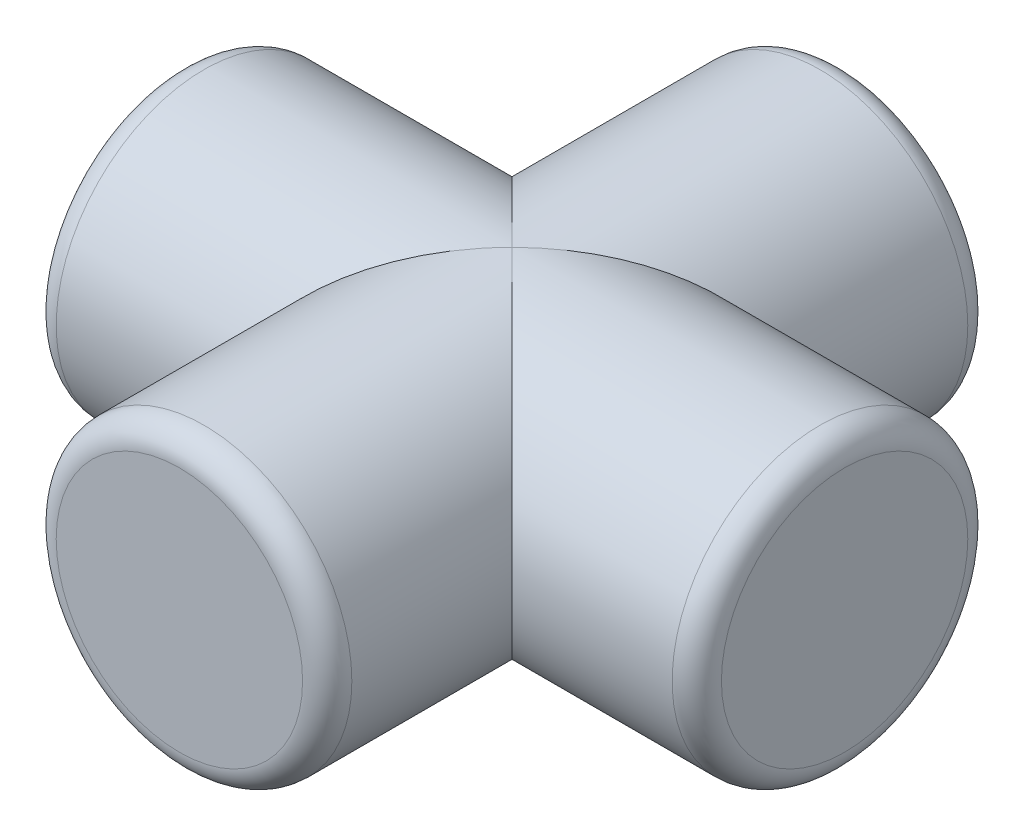
ISO-10303-21;
HEADER;
FILE_DESCRIPTION(('STEP AP214'),'2;1');
FILE_NAME('part.step','',(''),(''),'','','');
FILE_SCHEMA(('AUTOMOTIVE_DESIGN { 1 0 10303 214 1 1 1 1 }'));
ENDSEC;
DATA;
#1=APPLICATION_CONTEXT('core data for automotive mechanical design processes');
#2=APPLICATION_PROTOCOL_DEFINITION('international standard','automotive_design',2000,#1);
#3=PRODUCT_CONTEXT('',#1,'mechanical');
#4=PRODUCT('Part','Part','',(#3));
#5=PRODUCT_RELATED_PRODUCT_CATEGORY('part','',(#4));
#6=PRODUCT_DEFINITION_FORMATION('','',#4);
#7=PRODUCT_DEFINITION_CONTEXT('part definition',#1,'design');
#8=PRODUCT_DEFINITION('design','',#6,#7);
#9=PRODUCT_DEFINITION_SHAPE('','',#8);
#10=(LENGTH_UNIT() NAMED_UNIT(*) SI_UNIT(.MILLI.,.METRE.));
#11=(NAMED_UNIT(*) PLANE_ANGLE_UNIT() SI_UNIT($,.RADIAN.));
#12=(NAMED_UNIT(*) SI_UNIT($,.STERADIAN.) SOLID_ANGLE_UNIT());
#13=UNCERTAINTY_MEASURE_WITH_UNIT(LENGTH_MEASURE(1.E-05),#10,'distance_accuracy_value','');
#14=(GEOMETRIC_REPRESENTATION_CONTEXT(3) GLOBAL_UNCERTAINTY_ASSIGNED_CONTEXT((#13)) GLOBAL_UNIT_ASSIGNED_CONTEXT((#10,
#11,#12)) REPRESENTATION_CONTEXT('',''));
#15=CARTESIAN_POINT('',(0.,0.,0.));
#16=DIRECTION('',(0.,0.,1.));
#17=DIRECTION('',(1.,0.,0.));
#18=AXIS2_PLACEMENT_3D('',#15,#16,#17);
#19=CARTESIAN_POINT('',(-7.59548655631929E-06,0.,51.4350075954866));
#20=DIRECTION('',(0.,0.,-1.));
#21=DIRECTION('',(-1.,0.,0.));
#22=AXIS2_PLACEMENT_3D('',#19,#20,#21);
#23=CYLINDRICAL_SURFACE('',#22,15.24);
#24=CARTESIAN_POINT('',(-7.59548655631929E-06,0.,-14.6049924045134));
#25=DIRECTION('',(0.,0.,1.));
#26=DIRECTION('',(1.,0.,0.));
#27=AXIS2_PLACEMENT_3D('',#24,#25,#26);
#28=CIRCLE('',#27,15.24);
#29=CARTESIAN_POINT('',(15.2399924045134,0.,-14.6049924045134));
#30=VERTEX_POINT('',#29);
#31=EDGE_CURVE('E47',#30,#30,#28,.T.);
#32=ORIENTED_EDGE('',*,*,#31,.T.);
#33=EDGE_LOOP('',(#32));
#34=FACE_BOUND('',#33,.T.);
#35=CARTESIAN_POINT('',(-7.59548655631929E-06,0.,17.1450075954866));
#36=DIRECTION('',(-0.707106781186547,0.,-0.707106781186547));
#37=DIRECTION('',(0.707106781186547,0.,-0.707106781186547));
#38=AXIS2_PLACEMENT_3D('',#35,#36,#37);
#39=ELLIPSE('',#38,21.552614690566,15.24);
#40=CARTESIAN_POINT('',(-7.59548655631929E-06,15.24,17.1450075954866));
#41=VERTEX_POINT('',#40);
#42=CARTESIAN_POINT('',(-7.59548655631929E-06,-15.24,17.1450075954866));
#43=VERTEX_POINT('',#42);
#44=EDGE_CURVE('E59',#41,#43,#39,.T.);
#45=ORIENTED_EDGE('',*,*,#44,.T.);
#46=CARTESIAN_POINT('',(-7.59548655631929E-06,0.,17.1450075954866));
#47=DIRECTION('',(0.707106781186547,0.,-0.707106781186547));
#48=DIRECTION('',(-0.707106781186547,0.,-0.707106781186547));
#49=AXIS2_PLACEMENT_3D('',#46,#47,#48);
#50=ELLIPSE('',#49,21.552614690566,15.24);
#51=EDGE_CURVE('E65',#43,#41,#50,.T.);
#52=ORIENTED_EDGE('',*,*,#51,.T.);
#53=EDGE_LOOP('',(#45,#52));
#54=FACE_BOUND('',#53,.T.);
#55=ADVANCED_FACE('F38',(#34,#54),#23,.T.);
#56=CARTESIAN_POINT('',(-7.59548655631929E-06,0.,-17.1449924045134));
#57=DIRECTION('',(0.,0.,1.));
#58=DIRECTION('',(1.,0.,0.));
#59=AXIS2_PLACEMENT_3D('',#56,#57,#58);
#60=PLANE('',#59);
#61=CARTESIAN_POINT('',(-7.59548655631929E-06,0.,-17.1449924045134));
#62=DIRECTION('',(0.,0.,1.));
#63=DIRECTION('',(1.,0.,0.));
#64=AXIS2_PLACEMENT_3D('',#61,#62,#63);
#65=CIRCLE('',#64,12.7);
#66=CARTESIAN_POINT('',(12.6999924045134,0.,-17.1449924045134));
#67=VERTEX_POINT('',#66);
#68=EDGE_CURVE('E11',#67,#67,#65,.F.);
#69=ORIENTED_EDGE('',*,*,#68,.T.);
#70=EDGE_LOOP('',(#69));
#71=FACE_BOUND('',#70,.T.);
#72=ADVANCED_FACE('F115',(#71),#60,.F.);
#73=CARTESIAN_POINT('',(-34.2900075954866,0.,17.1450075954866));
#74=DIRECTION('',(1.,0.,0.));
#75=DIRECTION('',(0.,0.,-1.));
#76=AXIS2_PLACEMENT_3D('',#73,#74,#75);
#77=PLANE('',#76);
#78=CARTESIAN_POINT('',(-34.2900075954866,0.,17.1450075954866));
#79=DIRECTION('',(1.,0.,0.));
#80=DIRECTION('',(0.,0.,-1.));
#81=AXIS2_PLACEMENT_3D('',#78,#79,#80);
#82=CIRCLE('',#81,12.7);
#83=CARTESIAN_POINT('',(-34.2900075954866,0.,4.44500759548655));
#84=VERTEX_POINT('',#83);
#85=EDGE_CURVE('E97',#84,#84,#82,.F.);
#86=ORIENTED_EDGE('',*,*,#85,.T.);
#87=EDGE_LOOP('',(#86));
#88=FACE_BOUND('',#87,.T.);
#89=ADVANCED_FACE('F120',(#88),#77,.F.);
#90=CARTESIAN_POINT('',(-34.2900075954866,0.,17.1450075954866));
#91=DIRECTION('',(1.,0.,0.));
#92=DIRECTION('',(0.,0.,-1.));
#93=AXIS2_PLACEMENT_3D('',#90,#91,#92);
#94=CYLINDRICAL_SURFACE('',#93,15.24);
#95=CARTESIAN_POINT('',(-31.7500075954866,0.,17.1450075954866));
#96=DIRECTION('',(1.,0.,0.));
#97=DIRECTION('',(0.,0.,-1.));
#98=AXIS2_PLACEMENT_3D('',#95,#96,#97);
#99=CIRCLE('',#98,15.24);
#100=CARTESIAN_POINT('',(-31.7500075954866,0.,1.90500759548655));
#101=VERTEX_POINT('',#100);
#102=EDGE_CURVE('E93',#101,#101,#99,.T.);
#103=ORIENTED_EDGE('',*,*,#102,.T.);
#104=EDGE_LOOP('',(#103));
#105=FACE_BOUND('',#104,.T.);
#106=ORIENTED_EDGE('',*,*,#51,.F.);
#107=CARTESIAN_POINT('',(-7.59548655631929E-06,0.,17.1450075954866));
#108=DIRECTION('',(-0.707106781186547,0.,-0.707106781186547));
#109=DIRECTION('',(0.707106781186547,0.,-0.707106781186547));
#110=AXIS2_PLACEMENT_3D('',#107,#108,#109);
#111=ELLIPSE('',#110,21.552614690566,15.24);
#112=EDGE_CURVE('E53',#41,#43,#111,.F.);
#113=ORIENTED_EDGE('',*,*,#112,.F.);
#114=EDGE_LOOP('',(#106,#113));
#115=FACE_BOUND('',#114,.T.);
#116=ADVANCED_FACE('F68',(#105,#115),#94,.T.);
#117=CARTESIAN_POINT('',(31.7499924045134,0.,17.1450075954866));
#118=DIRECTION('',(1.,0.,0.));
#119=DIRECTION('',(0.,0.,-1.));
#120=AXIS2_PLACEMENT_3D('',#117,#118,#119);
#121=CIRCLE('',#120,15.24);
#122=CARTESIAN_POINT('',(31.7499924045134,0.,1.90500759548655));
#123=VERTEX_POINT('',#122);
#124=EDGE_CURVE('E89',#123,#123,#121,.F.);
#125=ORIENTED_EDGE('',*,*,#124,.T.);
#126=EDGE_LOOP('',(#125));
#127=FACE_BOUND('',#126,.T.);
#128=CARTESIAN_POINT('',(-7.59548655631929E-06,0.,17.1450075954866));
#129=DIRECTION('',(0.707106781186547,0.,-0.707106781186547));
#130=DIRECTION('',(-0.707106781186547,0.,-0.707106781186547));
#131=AXIS2_PLACEMENT_3D('',#128,#129,#130);
#132=ELLIPSE('',#131,21.552614690566,15.24);
#133=EDGE_CURVE('E61',#43,#41,#132,.F.);
#134=ORIENTED_EDGE('',*,*,#133,.F.);
#135=ORIENTED_EDGE('',*,*,#44,.F.);
#136=EDGE_LOOP('',(#134,#135));
#137=FACE_BOUND('',#136,.T.);
#138=ADVANCED_FACE('F60',(#127,#137),#94,.T.);
#139=CARTESIAN_POINT('',(34.2899924045134,0.,17.1450075954866));
#140=DIRECTION('',(1.,0.,0.));
#141=DIRECTION('',(0.,0.,-1.));
#142=AXIS2_PLACEMENT_3D('',#139,#140,#141);
#143=PLANE('',#142);
#144=CARTESIAN_POINT('',(34.2899924045134,0.,17.1450075954866));
#145=DIRECTION('',(1.,0.,0.));
#146=DIRECTION('',(0.,0.,-1.));
#147=AXIS2_PLACEMENT_3D('',#144,#145,#146);
#148=CIRCLE('',#147,12.7);
#149=CARTESIAN_POINT('',(34.2899924045134,0.,4.44500759548655));
#150=VERTEX_POINT('',#149);
#151=EDGE_CURVE('E85',#150,#150,#148,.T.);
#152=ORIENTED_EDGE('',*,*,#151,.T.);
#153=EDGE_LOOP('',(#152));
#154=FACE_BOUND('',#153,.T.);
#155=ADVANCED_FACE('F133',(#154),#143,.T.);
#156=CARTESIAN_POINT('',(-7.59548655631929E-06,0.,51.4350075954866));
#157=DIRECTION('',(0.,0.,1.));
#158=DIRECTION('',(1.,0.,0.));
#159=AXIS2_PLACEMENT_3D('',#156,#157,#158);
#160=PLANE('',#159);
#161=CARTESIAN_POINT('',(-7.59548655631929E-06,0.,51.4350075954866));
#162=DIRECTION('',(0.,0.,1.));
#163=DIRECTION('',(1.,0.,0.));
#164=AXIS2_PLACEMENT_3D('',#161,#162,#163);
#165=CIRCLE('',#164,12.7);
#166=CARTESIAN_POINT('',(12.6999924045134,0.,51.4350075954866));
#167=VERTEX_POINT('',#166);
#168=EDGE_CURVE('E73',#167,#167,#165,.T.);
#169=ORIENTED_EDGE('',*,*,#168,.T.);
#170=EDGE_LOOP('',(#169));
#171=FACE_BOUND('',#170,.T.);
#172=ADVANCED_FACE('F126',(#171),#160,.T.);
#173=CARTESIAN_POINT('',(-7.59548655631929E-06,0.,48.8950075954866));
#174=DIRECTION('',(0.,0.,1.));
#175=DIRECTION('',(1.,0.,0.));
#176=AXIS2_PLACEMENT_3D('',#173,#174,#175);
#177=CIRCLE('',#176,15.24);
#178=CARTESIAN_POINT('',(15.2399924045134,0.,48.8950075954866));
#179=VERTEX_POINT('',#178);
#180=EDGE_CURVE('E81',#179,#179,#177,.F.);
#181=ORIENTED_EDGE('',*,*,#180,.T.);
#182=EDGE_LOOP('',(#181));
#183=FACE_BOUND('',#182,.T.);
#184=ORIENTED_EDGE('',*,*,#112,.T.);
#185=ORIENTED_EDGE('',*,*,#133,.T.);
#186=EDGE_LOOP('',(#184,#185));
#187=FACE_BOUND('',#186,.T.);
#188=ADVANCED_FACE('F71',(#183,#187),#23,.T.);
#189=CARTESIAN_POINT('',(-7.59548655631929E-06,0.,48.8950075954866));
#190=DIRECTION('',(0.,0.,1.));
#191=DIRECTION('',(1.,0.,0.));
#192=AXIS2_PLACEMENT_3D('',#189,#190,#191);
#193=TOROIDAL_SURFACE('',#192,12.7,2.54);
#194=ORIENTED_EDGE('',*,*,#180,.F.);
#195=EDGE_LOOP('',(#194));
#196=FACE_BOUND('',#195,.T.);
#197=ORIENTED_EDGE('',*,*,#168,.F.);
#198=EDGE_LOOP('',(#197));
#199=FACE_BOUND('',#198,.T.);
#200=ADVANCED_FACE('F125',(#196,#199),#193,.T.);
#201=CARTESIAN_POINT('',(31.7499924045134,0.,17.1450075954866));
#202=DIRECTION('',(1.,0.,0.));
#203=DIRECTION('',(0.,0.,-1.));
#204=AXIS2_PLACEMENT_3D('',#201,#202,#203);
#205=TOROIDAL_SURFACE('',#204,12.7,2.54);
#206=ORIENTED_EDGE('',*,*,#124,.F.);
#207=EDGE_LOOP('',(#206));
#208=FACE_BOUND('',#207,.T.);
#209=ORIENTED_EDGE('',*,*,#151,.F.);
#210=EDGE_LOOP('',(#209));
#211=FACE_BOUND('',#210,.T.);
#212=ADVANCED_FACE('F111',(#208,#211),#205,.T.);
#213=CARTESIAN_POINT('',(-31.7500075954866,0.,17.1450075954866));
#214=DIRECTION('',(1.,0.,0.));
#215=DIRECTION('',(0.,0.,-1.));
#216=AXIS2_PLACEMENT_3D('',#213,#214,#215);
#217=TOROIDAL_SURFACE('',#216,12.7,2.54);
#218=ORIENTED_EDGE('',*,*,#85,.F.);
#219=EDGE_LOOP('',(#218));
#220=FACE_BOUND('',#219,.T.);
#221=ORIENTED_EDGE('',*,*,#102,.F.);
#222=EDGE_LOOP('',(#221));
#223=FACE_BOUND('',#222,.T.);
#224=ADVANCED_FACE('F106',(#220,#223),#217,.T.);
#225=CARTESIAN_POINT('',(-7.59548655631929E-06,0.,-14.6049924045134));
#226=DIRECTION('',(0.,0.,1.));
#227=DIRECTION('',(1.,0.,0.));
#228=AXIS2_PLACEMENT_3D('',#225,#226,#227);
#229=TOROIDAL_SURFACE('',#228,12.7,2.54);
#230=ORIENTED_EDGE('',*,*,#68,.F.);
#231=EDGE_LOOP('',(#230));
#232=FACE_BOUND('',#231,.T.);
#233=ORIENTED_EDGE('',*,*,#31,.F.);
#234=EDGE_LOOP('',(#233));
#235=FACE_BOUND('',#234,.T.);
#236=ADVANCED_FACE('F40',(#232,#235),#229,.T.);
#237=CLOSED_SHELL('',(#55,#72,#89,#116,#138,#155,#172,#188,#200,#212,#224,#236));
#238=MANIFOLD_SOLID_BREP('B2',#237);
#239=ADVANCED_BREP_SHAPE_REPRESENTATION('',(#18,#238),#14);
#240=SHAPE_DEFINITION_REPRESENTATION(#9,#239);
ENDSEC;
END-ISO-10303-21;
